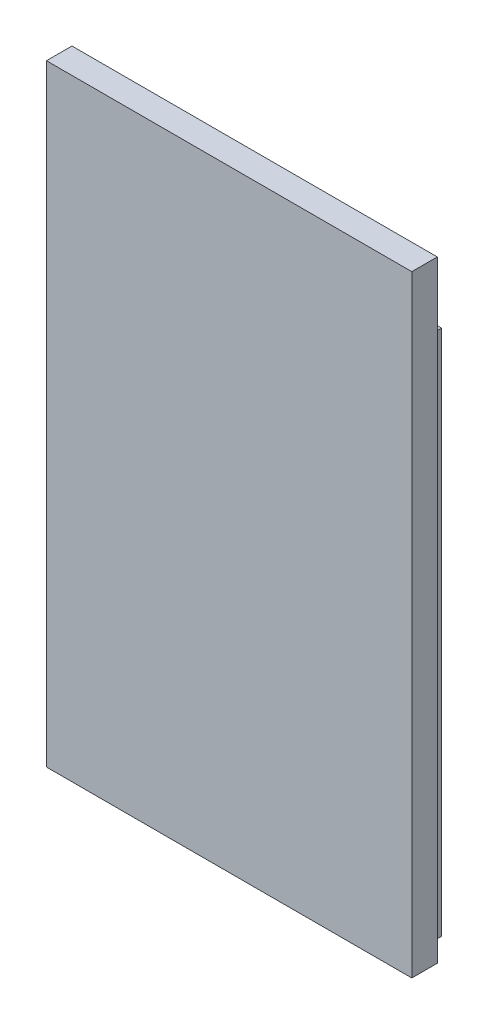
ISO-10303-21;
HEADER;
FILE_DESCRIPTION(('STEP AP214'),'2;1');
FILE_NAME('part.step','',(''),(''),'','','');
FILE_SCHEMA(('AUTOMOTIVE_DESIGN { 1 0 10303 214 1 1 1 1 }'));
ENDSEC;
DATA;
#1=APPLICATION_CONTEXT('core data for automotive mechanical design processes');
#2=APPLICATION_PROTOCOL_DEFINITION('international standard','automotive_design',2000,#1);
#3=PRODUCT_CONTEXT('',#1,'mechanical');
#4=PRODUCT('Part','Part','',(#3));
#5=PRODUCT_RELATED_PRODUCT_CATEGORY('part','',(#4));
#6=PRODUCT_DEFINITION_FORMATION('','',#4);
#7=PRODUCT_DEFINITION_CONTEXT('part definition',#1,'design');
#8=PRODUCT_DEFINITION('design','',#6,#7);
#9=PRODUCT_DEFINITION_SHAPE('','',#8);
#10=(LENGTH_UNIT() NAMED_UNIT(*) SI_UNIT(.MILLI.,.METRE.));
#11=(NAMED_UNIT(*) PLANE_ANGLE_UNIT() SI_UNIT($,.RADIAN.));
#12=(NAMED_UNIT(*) SI_UNIT($,.STERADIAN.) SOLID_ANGLE_UNIT());
#13=UNCERTAINTY_MEASURE_WITH_UNIT(LENGTH_MEASURE(1.E-05),#10,'distance_accuracy_value','');
#14=(GEOMETRIC_REPRESENTATION_CONTEXT(3) GLOBAL_UNCERTAINTY_ASSIGNED_CONTEXT((#13)) GLOBAL_UNIT_ASSIGNED_CONTEXT((#10,
#11,#12)) REPRESENTATION_CONTEXT('',''));
#15=CARTESIAN_POINT('',(0.,0.,0.));
#16=DIRECTION('',(0.,0.,1.));
#17=DIRECTION('',(1.,0.,0.));
#18=AXIS2_PLACEMENT_3D('',#15,#16,#17);
#19=CARTESIAN_POINT('',(0.,0.,1.5));
#20=DIRECTION('',(1.,0.,0.));
#21=DIRECTION('',(0.,0.,-1.));
#22=AXIS2_PLACEMENT_3D('',#19,#20,#21);
#23=PLANE('',#22);
#24=DIRECTION('',(0.,-1.,0.));
#25=VECTOR('',#24,1.);
#26=CARTESIAN_POINT('',(0.,0.,0.));
#27=LINE('',#26,#25);
#28=CARTESIAN_POINT('',(0.,36.,0.));
#29=VERTEX_POINT('',#28);
#30=CARTESIAN_POINT('',(0.,0.,0.));
#31=VERTEX_POINT('',#30);
#32=EDGE_CURVE('E178',#29,#31,#27,.T.);
#33=ORIENTED_EDGE('',*,*,#32,.T.);
#34=DIRECTION('',(0.,0.,-1.));
#35=VECTOR('',#34,1.);
#36=CARTESIAN_POINT('',(0.,0.,1.5));
#37=LINE('',#36,#35);
#38=CARTESIAN_POINT('',(0.,0.,1.5));
#39=VERTEX_POINT('',#38);
#40=EDGE_CURVE('E238',#39,#31,#37,.T.);
#41=ORIENTED_EDGE('',*,*,#40,.F.);
#42=DIRECTION('',(0.,-1.,0.));
#43=VECTOR('',#42,1.);
#44=CARTESIAN_POINT('',(0.,0.,1.5));
#45=LINE('',#44,#43);
#46=CARTESIAN_POINT('',(0.,36.,1.5));
#47=VERTEX_POINT('',#46);
#48=EDGE_CURVE('E199',#47,#39,#45,.T.);
#49=ORIENTED_EDGE('',*,*,#48,.F.);
#50=DIRECTION('',(0.,0.,-1.));
#51=VECTOR('',#50,1.);
#52=CARTESIAN_POINT('',(0.,36.,1.5));
#53=LINE('',#52,#51);
#54=EDGE_CURVE('E213',#47,#29,#53,.T.);
#55=ORIENTED_EDGE('',*,*,#54,.T.);
#56=EDGE_LOOP('',(#33,#41,#49,#55));
#57=FACE_BOUND('',#56,.T.);
#58=ADVANCED_FACE('F39',(#57),#23,.F.);
#59=CARTESIAN_POINT('',(0.,0.,1.5));
#60=DIRECTION('',(0.,1.,0.));
#61=DIRECTION('',(0.,0.,1.));
#62=AXIS2_PLACEMENT_3D('',#59,#60,#61);
#63=PLANE('',#62);
#64=DIRECTION('',(0.,0.,-1.));
#65=VECTOR('',#64,1.);
#66=CARTESIAN_POINT('',(21.5,0.,1.5));
#67=LINE('',#66,#65);
#68=CARTESIAN_POINT('',(21.5,0.,1.5));
#69=VERTEX_POINT('',#68);
#70=CARTESIAN_POINT('',(21.5,0.,0.));
#71=VERTEX_POINT('',#70);
#72=EDGE_CURVE('E234',#69,#71,#67,.T.);
#73=ORIENTED_EDGE('',*,*,#72,.F.);
#74=DIRECTION('',(1.,0.,0.));
#75=VECTOR('',#74,1.);
#76=CARTESIAN_POINT('',(0.,0.,1.5));
#77=LINE('',#76,#75);
#78=EDGE_CURVE('E203',#39,#69,#77,.T.);
#79=ORIENTED_EDGE('',*,*,#78,.F.);
#80=ORIENTED_EDGE('',*,*,#40,.T.);
#81=DIRECTION('',(1.,0.,0.));
#82=VECTOR('',#81,1.);
#83=CARTESIAN_POINT('',(0.,0.,0.));
#84=LINE('',#83,#82);
#85=CARTESIAN_POINT('',(3.74999999999999,0.,0.));
#86=VERTEX_POINT('',#85);
#87=EDGE_CURVE('E218',#31,#86,#84,.T.);
#88=ORIENTED_EDGE('',*,*,#87,.T.);
#89=DIRECTION('',(0.,0.,1.));
#90=VECTOR('',#89,1.);
#91=CARTESIAN_POINT('',(3.74999999999999,0.,-1.5));
#92=LINE('',#91,#90);
#93=CARTESIAN_POINT('',(3.74999999999999,0.,-1.5));
#94=VERTEX_POINT('',#93);
#95=EDGE_CURVE('E174',#94,#86,#92,.T.);
#96=ORIENTED_EDGE('',*,*,#95,.F.);
#97=DIRECTION('',(1.,0.,0.));
#98=VECTOR('',#97,1.);
#99=CARTESIAN_POINT('',(0.,0.,-1.5));
#100=LINE('',#99,#98);
#101=CARTESIAN_POINT('',(20.25,0.,-1.5));
#102=VERTEX_POINT('',#101);
#103=EDGE_CURVE('E159',#94,#102,#100,.T.);
#104=ORIENTED_EDGE('',*,*,#103,.T.);
#105=DIRECTION('',(0.,0.,1.));
#106=VECTOR('',#105,1.);
#107=CARTESIAN_POINT('',(20.25,0.,-1.5));
#108=LINE('',#107,#106);
#109=CARTESIAN_POINT('',(20.25,0.,0.));
#110=VERTEX_POINT('',#109);
#111=EDGE_CURVE('E187',#102,#110,#108,.T.);
#112=ORIENTED_EDGE('',*,*,#111,.T.);
#113=EDGE_CURVE('E217',#110,#71,#84,.T.);
#114=ORIENTED_EDGE('',*,*,#113,.T.);
#115=EDGE_LOOP('',(#73,#79,#80,#88,#96,#104,#112,#114));
#116=FACE_BOUND('',#115,.T.);
#117=ADVANCED_FACE('F275',(#116),#63,.F.);
#118=CARTESIAN_POINT('',(21.5,0.,1.5));
#119=DIRECTION('',(-1.,0.,0.));
#120=DIRECTION('',(0.,-1.,0.));
#121=AXIS2_PLACEMENT_3D('',#118,#119,#120);
#122=PLANE('',#121);
#123=DIRECTION('',(0.,1.,0.));
#124=VECTOR('',#123,1.);
#125=CARTESIAN_POINT('',(21.5,0.,0.));
#126=LINE('',#125,#124);
#127=CARTESIAN_POINT('',(21.5,36.,0.));
#128=VERTEX_POINT('',#127);
#129=EDGE_CURVE('E222',#71,#128,#126,.T.);
#130=ORIENTED_EDGE('',*,*,#129,.T.);
#131=DIRECTION('',(0.,0.,-1.));
#132=VECTOR('',#131,1.);
#133=CARTESIAN_POINT('',(21.5,36.,1.5));
#134=LINE('',#133,#132);
#135=CARTESIAN_POINT('',(21.5,36.,1.5));
#136=VERTEX_POINT('',#135);
#137=EDGE_CURVE('E230',#136,#128,#134,.T.);
#138=ORIENTED_EDGE('',*,*,#137,.F.);
#139=DIRECTION('',(0.,1.,0.));
#140=VECTOR('',#139,1.);
#141=CARTESIAN_POINT('',(21.5,0.,1.5));
#142=LINE('',#141,#140);
#143=EDGE_CURVE('E207',#69,#136,#142,.T.);
#144=ORIENTED_EDGE('',*,*,#143,.F.);
#145=ORIENTED_EDGE('',*,*,#72,.T.);
#146=EDGE_LOOP('',(#130,#138,#144,#145));
#147=FACE_BOUND('',#146,.T.);
#148=ADVANCED_FACE('F280',(#147),#122,.F.);
#149=CARTESIAN_POINT('',(0.,36.,1.5));
#150=DIRECTION('',(0.,-1.,0.));
#151=DIRECTION('',(0.,0.,-1.));
#152=AXIS2_PLACEMENT_3D('',#149,#150,#151);
#153=PLANE('',#152);
#154=DIRECTION('',(-1.,0.,0.));
#155=VECTOR('',#154,1.);
#156=CARTESIAN_POINT('',(0.,36.,0.));
#157=LINE('',#156,#155);
#158=EDGE_CURVE('E204',#128,#29,#157,.T.);
#159=ORIENTED_EDGE('',*,*,#158,.T.);
#160=ORIENTED_EDGE('',*,*,#54,.F.);
#161=DIRECTION('',(-1.,0.,0.));
#162=VECTOR('',#161,1.);
#163=CARTESIAN_POINT('',(0.,36.,1.5));
#164=LINE('',#163,#162);
#165=EDGE_CURVE('E210',#136,#47,#164,.T.);
#166=ORIENTED_EDGE('',*,*,#165,.F.);
#167=ORIENTED_EDGE('',*,*,#137,.T.);
#168=EDGE_LOOP('',(#159,#160,#166,#167));
#169=FACE_BOUND('',#168,.T.);
#170=ADVANCED_FACE('F296',(#169),#153,.F.);
#171=CARTESIAN_POINT('',(0.,0.,1.5));
#172=DIRECTION('',(0.,0.,-1.));
#173=DIRECTION('',(-1.,0.,0.));
#174=AXIS2_PLACEMENT_3D('',#171,#172,#173);
#175=PLANE('',#174);
#176=ORIENTED_EDGE('',*,*,#78,.T.);
#177=ORIENTED_EDGE('',*,*,#143,.T.);
#178=ORIENTED_EDGE('',*,*,#165,.T.);
#179=ORIENTED_EDGE('',*,*,#48,.T.);
#180=EDGE_LOOP('',(#176,#177,#178,#179));
#181=FACE_BOUND('',#180,.T.);
#182=ADVANCED_FACE('F292',(#181),#175,.F.);
#183=CARTESIAN_POINT('',(0.,0.,0.));
#184=DIRECTION('',(0.,0.,-1.));
#185=DIRECTION('',(-1.,0.,0.));
#186=AXIS2_PLACEMENT_3D('',#183,#184,#185);
#187=PLANE('',#186);
#188=DIRECTION('',(0.,1.,0.));
#189=VECTOR('',#188,1.);
#190=CARTESIAN_POINT('',(3.74999999999999,0.,0.));
#191=LINE('',#190,#189);
#192=CARTESIAN_POINT('',(3.74999999999999,31.,0.));
#193=VERTEX_POINT('',#192);
#194=EDGE_CURVE('E248',#86,#193,#191,.T.);
#195=ORIENTED_EDGE('',*,*,#194,.F.);
#196=ORIENTED_EDGE('',*,*,#87,.F.);
#197=ORIENTED_EDGE('',*,*,#32,.F.);
#198=ORIENTED_EDGE('',*,*,#158,.F.);
#199=ORIENTED_EDGE('',*,*,#129,.F.);
#200=ORIENTED_EDGE('',*,*,#113,.F.);
#201=DIRECTION('',(0.,-1.,0.));
#202=VECTOR('',#201,1.);
#203=CARTESIAN_POINT('',(20.25,0.,0.));
#204=LINE('',#203,#202);
#205=CARTESIAN_POINT('',(20.25,31.,0.));
#206=VERTEX_POINT('',#205);
#207=EDGE_CURVE('E242',#206,#110,#204,.T.);
#208=ORIENTED_EDGE('',*,*,#207,.F.);
#209=DIRECTION('',(1.,0.,0.));
#210=VECTOR('',#209,1.);
#211=CARTESIAN_POINT('',(0.,31.,0.));
#212=LINE('',#211,#210);
#213=EDGE_CURVE('E62',#193,#206,#212,.T.);
#214=ORIENTED_EDGE('',*,*,#213,.F.);
#215=EDGE_LOOP('',(#195,#196,#197,#198,#199,#200,#208,#214));
#216=FACE_BOUND('',#215,.T.);
#217=ADVANCED_FACE('F287',(#216),#187,.T.);
#218=CARTESIAN_POINT('',(3.74999999999999,0.,-1.5));
#219=DIRECTION('',(-1.,0.,0.));
#220=DIRECTION('',(0.,0.,1.));
#221=AXIS2_PLACEMENT_3D('',#218,#219,#220);
#222=PLANE('',#221);
#223=ORIENTED_EDGE('',*,*,#95,.T.);
#224=ORIENTED_EDGE('',*,*,#194,.T.);
#225=DIRECTION('',(0.,0.,1.));
#226=VECTOR('',#225,1.);
#227=CARTESIAN_POINT('',(3.74999999999999,31.,-1.5));
#228=LINE('',#227,#226);
#229=CARTESIAN_POINT('',(3.74999999999999,31.,-1.5));
#230=VERTEX_POINT('',#229);
#231=EDGE_CURVE('E179',#230,#193,#228,.T.);
#232=ORIENTED_EDGE('',*,*,#231,.F.);
#233=DIRECTION('',(0.,-1.,0.));
#234=VECTOR('',#233,1.);
#235=CARTESIAN_POINT('',(3.74999999999999,0.,-1.5));
#236=LINE('',#235,#234);
#237=EDGE_CURVE('E146',#230,#94,#236,.T.);
#238=ORIENTED_EDGE('',*,*,#237,.T.);
#239=EDGE_LOOP('',(#223,#224,#232,#238));
#240=FACE_BOUND('',#239,.T.);
#241=ADVANCED_FACE('F305',(#240),#222,.T.);
#242=CARTESIAN_POINT('',(0.,31.,-1.5));
#243=DIRECTION('',(0.,1.,0.));
#244=DIRECTION('',(-1.,0.,0.));
#245=AXIS2_PLACEMENT_3D('',#242,#243,#244);
#246=PLANE('',#245);
#247=ORIENTED_EDGE('',*,*,#231,.T.);
#248=ORIENTED_EDGE('',*,*,#213,.T.);
#249=DIRECTION('',(0.,0.,1.));
#250=VECTOR('',#249,1.);
#251=CARTESIAN_POINT('',(20.25,31.,-1.5));
#252=LINE('',#251,#250);
#253=CARTESIAN_POINT('',(20.25,31.,-1.5));
#254=VERTEX_POINT('',#253);
#255=EDGE_CURVE('E183',#254,#206,#252,.T.);
#256=ORIENTED_EDGE('',*,*,#255,.F.);
#257=DIRECTION('',(-1.,0.,0.));
#258=VECTOR('',#257,1.);
#259=CARTESIAN_POINT('',(0.,31.,-1.5));
#260=LINE('',#259,#258);
#261=EDGE_CURVE('E167',#254,#230,#260,.T.);
#262=ORIENTED_EDGE('',*,*,#261,.T.);
#263=EDGE_LOOP('',(#247,#248,#256,#262));
#264=FACE_BOUND('',#263,.T.);
#265=ADVANCED_FACE('F307',(#264),#246,.T.);
#266=CARTESIAN_POINT('',(19.25,0.,-1.5));
#267=DIRECTION('',(1.,0.,0.));
#268=DIRECTION('',(0.,0.,-1.));
#269=AXIS2_PLACEMENT_3D('',#266,#267,#268);
#270=PLANE('',#269);
#271=DIRECTION('',(0.,-1.,0.));
#272=VECTOR('',#271,1.);
#273=CARTESIAN_POINT('',(19.25,0.,0.));
#274=LINE('',#273,#272);
#275=CARTESIAN_POINT('',(19.25,30.,0.));
#276=VERTEX_POINT('',#275);
#277=CARTESIAN_POINT('',(19.25,1.,0.));
#278=VERTEX_POINT('',#277);
#279=EDGE_CURVE('E11',#276,#278,#274,.T.);
#280=ORIENTED_EDGE('',*,*,#279,.F.);
#281=DIRECTION('',(0.,0.,1.));
#282=VECTOR('',#281,1.);
#283=CARTESIAN_POINT('',(19.25,30.,-1.5));
#284=LINE('',#283,#282);
#285=CARTESIAN_POINT('',(19.25,30.,-1.5));
#286=VERTEX_POINT('',#285);
#287=EDGE_CURVE('E150',#286,#276,#284,.T.);
#288=ORIENTED_EDGE('',*,*,#287,.F.);
#289=DIRECTION('',(0.,1.,0.));
#290=VECTOR('',#289,1.);
#291=CARTESIAN_POINT('',(19.25,0.,-1.5));
#292=LINE('',#291,#290);
#293=CARTESIAN_POINT('',(19.25,1.,-1.5));
#294=VERTEX_POINT('',#293);
#295=EDGE_CURVE('E133',#294,#286,#292,.T.);
#296=ORIENTED_EDGE('',*,*,#295,.F.);
#297=DIRECTION('',(0.,0.,1.));
#298=VECTOR('',#297,1.);
#299=CARTESIAN_POINT('',(19.25,1.,-1.5));
#300=LINE('',#299,#298);
#301=EDGE_CURVE('E140',#294,#278,#300,.T.);
#302=ORIENTED_EDGE('',*,*,#301,.T.);
#303=EDGE_LOOP('',(#280,#288,#296,#302));
#304=FACE_BOUND('',#303,.T.);
#305=ADVANCED_FACE('F148',(#304),#270,.F.);
#306=CARTESIAN_POINT('',(0.,30.,-1.5));
#307=DIRECTION('',(0.,1.,0.));
#308=DIRECTION('',(-1.,0.,0.));
#309=AXIS2_PLACEMENT_3D('',#306,#307,#308);
#310=PLANE('',#309);
#311=DIRECTION('',(1.,0.,0.));
#312=VECTOR('',#311,1.);
#313=CARTESIAN_POINT('',(0.,30.,0.));
#314=LINE('',#313,#312);
#315=CARTESIAN_POINT('',(4.74999999999999,30.,0.));
#316=VERTEX_POINT('',#315);
#317=EDGE_CURVE('E47',#316,#276,#314,.T.);
#318=ORIENTED_EDGE('',*,*,#317,.F.);
#319=DIRECTION('',(0.,0.,1.));
#320=VECTOR('',#319,1.);
#321=CARTESIAN_POINT('',(4.74999999999999,30.,-1.5));
#322=LINE('',#321,#320);
#323=CARTESIAN_POINT('',(4.74999999999999,30.,-1.5));
#324=VERTEX_POINT('',#323);
#325=EDGE_CURVE('E193',#324,#316,#322,.T.);
#326=ORIENTED_EDGE('',*,*,#325,.F.);
#327=DIRECTION('',(-1.,0.,0.));
#328=VECTOR('',#327,1.);
#329=CARTESIAN_POINT('',(0.,30.,-1.5));
#330=LINE('',#329,#328);
#331=EDGE_CURVE('E156',#286,#324,#330,.T.);
#332=ORIENTED_EDGE('',*,*,#331,.F.);
#333=ORIENTED_EDGE('',*,*,#287,.T.);
#334=EDGE_LOOP('',(#318,#326,#332,#333));
#335=FACE_BOUND('',#334,.T.);
#336=ADVANCED_FACE('F262',(#335),#310,.F.);
#337=CARTESIAN_POINT('',(4.74999999999999,0.,-1.5));
#338=DIRECTION('',(-1.,0.,0.));
#339=DIRECTION('',(0.,-1.,0.));
#340=AXIS2_PLACEMENT_3D('',#337,#338,#339);
#341=PLANE('',#340);
#342=DIRECTION('',(0.,1.,0.));
#343=VECTOR('',#342,1.);
#344=CARTESIAN_POINT('',(4.74999999999999,0.,0.));
#345=LINE('',#344,#343);
#346=CARTESIAN_POINT('',(4.74999999999999,1.,0.));
#347=VERTEX_POINT('',#346);
#348=EDGE_CURVE('E253',#347,#316,#345,.T.);
#349=ORIENTED_EDGE('',*,*,#348,.F.);
#350=DIRECTION('',(0.,0.,1.));
#351=VECTOR('',#350,1.);
#352=CARTESIAN_POINT('',(4.74999999999999,1.,-1.5));
#353=LINE('',#352,#351);
#354=CARTESIAN_POINT('',(4.74999999999999,1.,-1.5));
#355=VERTEX_POINT('',#354);
#356=EDGE_CURVE('E54',#355,#347,#353,.T.);
#357=ORIENTED_EDGE('',*,*,#356,.F.);
#358=DIRECTION('',(0.,-1.,0.));
#359=VECTOR('',#358,1.);
#360=CARTESIAN_POINT('',(4.74999999999999,0.,-1.5));
#361=LINE('',#360,#359);
#362=EDGE_CURVE('E136',#324,#355,#361,.T.);
#363=ORIENTED_EDGE('',*,*,#362,.F.);
#364=ORIENTED_EDGE('',*,*,#325,.T.);
#365=EDGE_LOOP('',(#349,#357,#363,#364));
#366=FACE_BOUND('',#365,.T.);
#367=ADVANCED_FACE('F264',(#366),#341,.F.);
#368=CARTESIAN_POINT('',(0.,1.,-1.5));
#369=DIRECTION('',(0.,-1.,0.));
#370=DIRECTION('',(0.,0.,-1.));
#371=AXIS2_PLACEMENT_3D('',#368,#369,#370);
#372=PLANE('',#371);
#373=DIRECTION('',(-1.,0.,0.));
#374=VECTOR('',#373,1.);
#375=CARTESIAN_POINT('',(0.,1.,0.));
#376=LINE('',#375,#374);
#377=EDGE_CURVE('E143',#278,#347,#376,.T.);
#378=ORIENTED_EDGE('',*,*,#377,.F.);
#379=ORIENTED_EDGE('',*,*,#301,.F.);
#380=DIRECTION('',(1.,0.,0.));
#381=VECTOR('',#380,1.);
#382=CARTESIAN_POINT('',(0.,1.,-1.5));
#383=LINE('',#382,#381);
#384=EDGE_CURVE('E128',#355,#294,#383,.T.);
#385=ORIENTED_EDGE('',*,*,#384,.F.);
#386=ORIENTED_EDGE('',*,*,#356,.T.);
#387=EDGE_LOOP('',(#378,#379,#385,#386));
#388=FACE_BOUND('',#387,.T.);
#389=ADVANCED_FACE('F141',(#388),#372,.F.);
#390=CARTESIAN_POINT('',(20.25,0.,-1.5));
#391=DIRECTION('',(1.,0.,0.));
#392=DIRECTION('',(0.,0.,-1.));
#393=AXIS2_PLACEMENT_3D('',#390,#391,#392);
#394=PLANE('',#393);
#395=ORIENTED_EDGE('',*,*,#255,.T.);
#396=ORIENTED_EDGE('',*,*,#207,.T.);
#397=ORIENTED_EDGE('',*,*,#111,.F.);
#398=DIRECTION('',(0.,1.,0.));
#399=VECTOR('',#398,1.);
#400=CARTESIAN_POINT('',(20.25,0.,-1.5));
#401=LINE('',#400,#399);
#402=EDGE_CURVE('E163',#102,#254,#401,.T.);
#403=ORIENTED_EDGE('',*,*,#402,.T.);
#404=EDGE_LOOP('',(#395,#396,#397,#403));
#405=FACE_BOUND('',#404,.T.);
#406=ADVANCED_FACE('F271',(#405),#394,.T.);
#407=CARTESIAN_POINT('',(0.,0.,-1.5));
#408=DIRECTION('',(0.,0.,1.));
#409=DIRECTION('',(1.,0.,0.));
#410=AXIS2_PLACEMENT_3D('',#407,#408,#409);
#411=PLANE('',#410);
#412=ORIENTED_EDGE('',*,*,#295,.T.);
#413=ORIENTED_EDGE('',*,*,#331,.T.);
#414=ORIENTED_EDGE('',*,*,#362,.T.);
#415=ORIENTED_EDGE('',*,*,#384,.T.);
#416=EDGE_LOOP('',(#412,#413,#414,#415));
#417=FACE_BOUND('',#416,.T.);
#418=ORIENTED_EDGE('',*,*,#103,.F.);
#419=ORIENTED_EDGE('',*,*,#237,.F.);
#420=ORIENTED_EDGE('',*,*,#261,.F.);
#421=ORIENTED_EDGE('',*,*,#402,.F.);
#422=EDGE_LOOP('',(#418,#419,#420,#421));
#423=FACE_BOUND('',#422,.T.);
#424=ADVANCED_FACE('F130',(#417,#423),#411,.F.);
#425=ORIENTED_EDGE('',*,*,#317,.T.);
#426=ORIENTED_EDGE('',*,*,#279,.T.);
#427=ORIENTED_EDGE('',*,*,#377,.T.);
#428=ORIENTED_EDGE('',*,*,#348,.T.);
#429=EDGE_LOOP('',(#425,#426,#427,#428));
#430=FACE_BOUND('',#429,.T.);
#431=ADVANCED_FACE('F259',(#430),#187,.T.);
#432=CLOSED_SHELL('',(#58,#117,#148,#170,#182,#217,#241,#265,#305,#336,#367,#389,#406,#424,#431));
#433=MANIFOLD_SOLID_BREP('B2',#432);
#434=ADVANCED_BREP_SHAPE_REPRESENTATION('',(#18,#433),#14);
#435=SHAPE_DEFINITION_REPRESENTATION(#9,#434);
ENDSEC;
END-ISO-10303-21;
